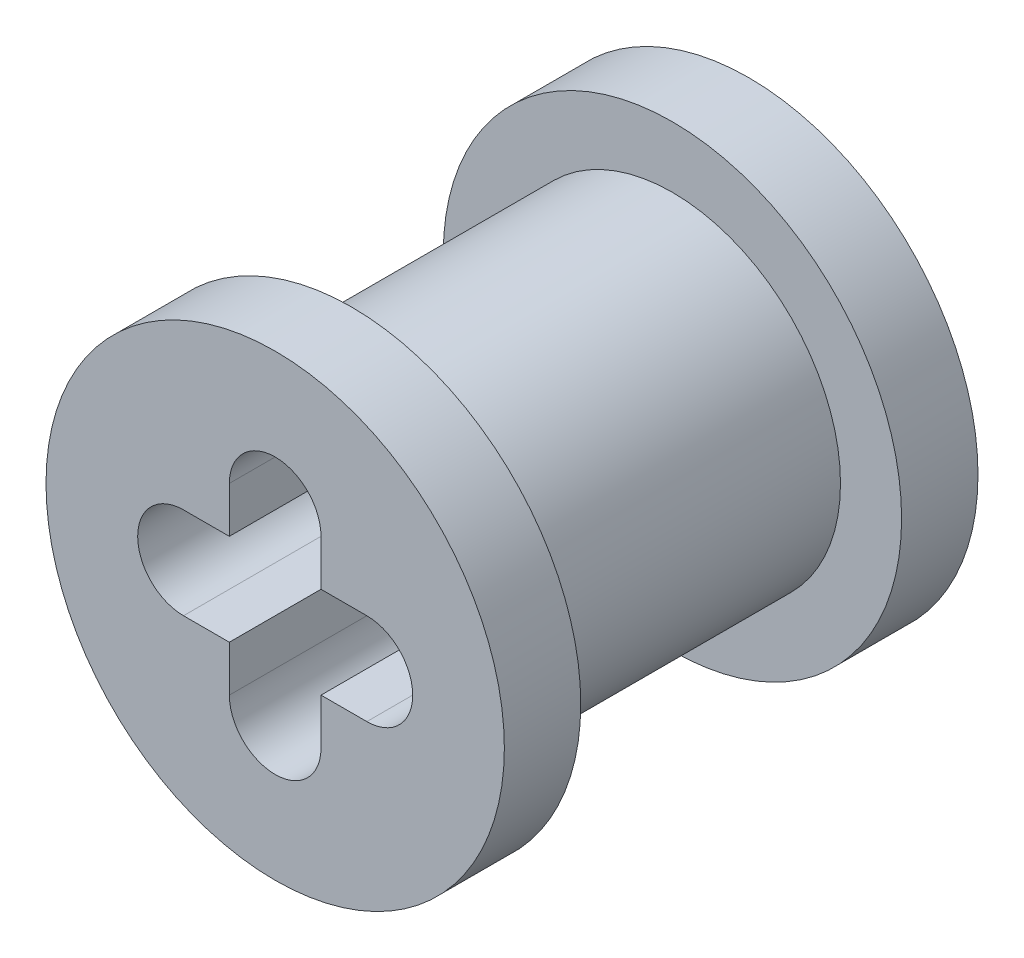
ISO-10303-21;
HEADER;
FILE_DESCRIPTION(('STEP AP214'),'2;1');
FILE_NAME('part.step','',(''),(''),'','','');
FILE_SCHEMA(('AUTOMOTIVE_DESIGN { 1 0 10303 214 1 1 1 1 }'));
ENDSEC;
DATA;
#1=APPLICATION_CONTEXT('core data for automotive mechanical design processes');
#2=APPLICATION_PROTOCOL_DEFINITION('international standard','automotive_design',2000,#1);
#3=PRODUCT_CONTEXT('',#1,'mechanical');
#4=PRODUCT('Part','Part','',(#3));
#5=PRODUCT_RELATED_PRODUCT_CATEGORY('part','',(#4));
#6=PRODUCT_DEFINITION_FORMATION('','',#4);
#7=PRODUCT_DEFINITION_CONTEXT('part definition',#1,'design');
#8=PRODUCT_DEFINITION('design','',#6,#7);
#9=PRODUCT_DEFINITION_SHAPE('','',#8);
#10=(LENGTH_UNIT() NAMED_UNIT(*) SI_UNIT(.MILLI.,.METRE.));
#11=(NAMED_UNIT(*) PLANE_ANGLE_UNIT() SI_UNIT($,.RADIAN.));
#12=(NAMED_UNIT(*) SI_UNIT($,.STERADIAN.) SOLID_ANGLE_UNIT());
#13=UNCERTAINTY_MEASURE_WITH_UNIT(LENGTH_MEASURE(1.E-05),#10,'distance_accuracy_value','');
#14=(GEOMETRIC_REPRESENTATION_CONTEXT(3) GLOBAL_UNCERTAINTY_ASSIGNED_CONTEXT((#13)) GLOBAL_UNIT_ASSIGNED_CONTEXT((#10,
#11,#12)) REPRESENTATION_CONTEXT('',''));
#15=CARTESIAN_POINT('',(0.,0.,0.));
#16=DIRECTION('',(0.,0.,1.));
#17=DIRECTION('',(1.,0.,0.));
#18=AXIS2_PLACEMENT_3D('',#15,#16,#17);
#19=CARTESIAN_POINT('',(7.874,0.,3.937));
#20=DIRECTION('',(0.,0.,-1.));
#21=DIRECTION('',(-1.,0.,0.));
#22=AXIS2_PLACEMENT_3D('',#19,#20,#21);
#23=CYLINDRICAL_SURFACE('',#22,2.794);
#24=CARTESIAN_POINT('',(7.874,0.,1.27));
#25=DIRECTION('',(0.,0.,-1.));
#26=DIRECTION('',(-1.,0.,0.));
#27=AXIS2_PLACEMENT_3D('',#24,#25,#26);
#28=CIRCLE('',#27,2.794);
#29=CARTESIAN_POINT('',(5.08,0.,1.27));
#30=VERTEX_POINT('',#29);
#31=EDGE_CURVE('E43',#30,#30,#28,.T.);
#32=ORIENTED_EDGE('',*,*,#31,.F.);
#33=EDGE_LOOP('',(#32));
#34=FACE_BOUND('',#33,.T.);
#35=CARTESIAN_POINT('',(7.874,0.,6.604));
#36=DIRECTION('',(0.,0.,1.));
#37=DIRECTION('',(1.,0.,0.));
#38=AXIS2_PLACEMENT_3D('',#35,#36,#37);
#39=CIRCLE('',#38,2.794);
#40=CARTESIAN_POINT('',(10.668,0.,6.604));
#41=VERTEX_POINT('',#40);
#42=EDGE_CURVE('E11',#41,#41,#39,.T.);
#43=ORIENTED_EDGE('',*,*,#42,.F.);
#44=EDGE_LOOP('',(#43));
#45=FACE_BOUND('',#44,.T.);
#46=ADVANCED_FACE('F36',(#34,#45),#23,.T.);
#47=CARTESIAN_POINT('',(7.874,-1.524,3.937));
#48=DIRECTION('',(0.,0.,-1.));
#49=DIRECTION('',(-1.,0.,0.));
#50=AXIS2_PLACEMENT_3D('',#47,#48,#49);
#51=CYLINDRICAL_SURFACE('',#50,0.762000000000002);
#52=CARTESIAN_POINT('',(7.874,-1.524,0.));
#53=DIRECTION('',(0.,0.,1.));
#54=DIRECTION('',(1.,0.,0.));
#55=AXIS2_PLACEMENT_3D('',#52,#53,#54);
#56=CIRCLE('',#55,0.762000000000002);
#57=CARTESIAN_POINT('',(7.112,-1.524,0.));
#58=VERTEX_POINT('',#57);
#59=CARTESIAN_POINT('',(8.636,-1.524,0.));
#60=VERTEX_POINT('',#59);
#61=EDGE_CURVE('E275',#58,#60,#56,.T.);
#62=ORIENTED_EDGE('',*,*,#61,.F.);
#63=DIRECTION('',(0.,0.,-1.));
#64=VECTOR('',#63,1.);
#65=CARTESIAN_POINT('',(7.112,-1.524,3.937));
#66=LINE('',#65,#64);
#67=CARTESIAN_POINT('',(7.112,-1.524,7.874));
#68=VERTEX_POINT('',#67);
#69=EDGE_CURVE('E131',#68,#58,#66,.T.);
#70=ORIENTED_EDGE('',*,*,#69,.F.);
#71=CARTESIAN_POINT('',(7.874,-1.524,7.874));
#72=DIRECTION('',(0.,0.,1.));
#73=DIRECTION('',(1.,0.,0.));
#74=AXIS2_PLACEMENT_3D('',#71,#72,#73);
#75=CIRCLE('',#74,0.762000000000002);
#76=CARTESIAN_POINT('',(8.636,-1.524,7.874));
#77=VERTEX_POINT('',#76);
#78=EDGE_CURVE('E129',#68,#77,#75,.T.);
#79=ORIENTED_EDGE('',*,*,#78,.T.);
#80=DIRECTION('',(0.,0.,-1.));
#81=VECTOR('',#80,1.);
#82=CARTESIAN_POINT('',(8.636,-1.524,3.937));
#83=LINE('',#82,#81);
#84=EDGE_CURVE('E50',#77,#60,#83,.T.);
#85=ORIENTED_EDGE('',*,*,#84,.T.);
#86=EDGE_LOOP('',(#62,#70,#79,#85));
#87=FACE_BOUND('',#86,.T.);
#88=ADVANCED_FACE('F130',(#87),#51,.F.);
#89=CARTESIAN_POINT('',(7.112,-6.28822135623731,3.937));
#90=DIRECTION('',(1.,0.,0.));
#91=DIRECTION('',(0.,0.,-1.));
#92=AXIS2_PLACEMENT_3D('',#89,#90,#91);
#93=PLANE('',#92);
#94=DIRECTION('',(0.,-1.,0.));
#95=VECTOR('',#94,1.);
#96=CARTESIAN_POINT('',(7.112,-6.28822135623731,0.));
#97=LINE('',#96,#95);
#98=CARTESIAN_POINT('',(7.112,-0.762000000000001,0.));
#99=VERTEX_POINT('',#98);
#100=EDGE_CURVE('E272',#99,#58,#97,.T.);
#101=ORIENTED_EDGE('',*,*,#100,.F.);
#102=DIRECTION('',(0.,0.,-1.));
#103=VECTOR('',#102,1.);
#104=CARTESIAN_POINT('',(7.112,-0.762000000000001,3.937));
#105=LINE('',#104,#103);
#106=CARTESIAN_POINT('',(7.112,-0.762000000000001,7.874));
#107=VERTEX_POINT('',#106);
#108=EDGE_CURVE('E183',#107,#99,#105,.T.);
#109=ORIENTED_EDGE('',*,*,#108,.F.);
#110=DIRECTION('',(0.,-1.,0.));
#111=VECTOR('',#110,1.);
#112=CARTESIAN_POINT('',(7.112,-6.28822135623731,7.874));
#113=LINE('',#112,#111);
#114=EDGE_CURVE('E171',#107,#68,#113,.T.);
#115=ORIENTED_EDGE('',*,*,#114,.T.);
#116=ORIENTED_EDGE('',*,*,#69,.T.);
#117=EDGE_LOOP('',(#101,#109,#115,#116));
#118=FACE_BOUND('',#117,.T.);
#119=ADVANCED_FACE('F261',(#118),#93,.T.);
#120=CARTESIAN_POINT('',(7.874,-0.762000000000001,3.937));
#121=DIRECTION('',(0.,1.,0.));
#122=DIRECTION('',(-1.,0.,0.));
#123=AXIS2_PLACEMENT_3D('',#120,#121,#122);
#124=PLANE('',#123);
#125=DIRECTION('',(1.,0.,0.));
#126=VECTOR('',#125,1.);
#127=CARTESIAN_POINT('',(7.874,-0.762000000000001,0.));
#128=LINE('',#127,#126);
#129=CARTESIAN_POINT('',(6.35,-0.762000000000002,0.));
#130=VERTEX_POINT('',#129);
#131=EDGE_CURVE('E274',#130,#99,#128,.T.);
#132=ORIENTED_EDGE('',*,*,#131,.F.);
#133=DIRECTION('',(0.,0.,-1.));
#134=VECTOR('',#133,1.);
#135=CARTESIAN_POINT('',(6.35,-0.762000000000002,3.937));
#136=LINE('',#135,#134);
#137=CARTESIAN_POINT('',(6.35,-0.762000000000002,7.874));
#138=VERTEX_POINT('',#137);
#139=EDGE_CURVE('E185',#138,#130,#136,.T.);
#140=ORIENTED_EDGE('',*,*,#139,.F.);
#141=DIRECTION('',(1.,0.,0.));
#142=VECTOR('',#141,1.);
#143=CARTESIAN_POINT('',(7.874,-0.762000000000001,7.874));
#144=LINE('',#143,#142);
#145=EDGE_CURVE('E147',#138,#107,#144,.T.);
#146=ORIENTED_EDGE('',*,*,#145,.T.);
#147=ORIENTED_EDGE('',*,*,#108,.T.);
#148=EDGE_LOOP('',(#132,#140,#146,#147));
#149=FACE_BOUND('',#148,.T.);
#150=ADVANCED_FACE('F182',(#149),#124,.T.);
#151=CARTESIAN_POINT('',(6.35,0.,3.937));
#152=DIRECTION('',(0.,0.,-1.));
#153=DIRECTION('',(-1.,0.,0.));
#154=AXIS2_PLACEMENT_3D('',#151,#152,#153);
#155=CYLINDRICAL_SURFACE('',#154,0.762000000000002);
#156=CARTESIAN_POINT('',(6.35,0.,0.));
#157=DIRECTION('',(0.,0.,1.));
#158=DIRECTION('',(1.,0.,0.));
#159=AXIS2_PLACEMENT_3D('',#156,#157,#158);
#160=CIRCLE('',#159,0.762000000000002);
#161=CARTESIAN_POINT('',(6.35,0.762000000000001,0.));
#162=VERTEX_POINT('',#161);
#163=EDGE_CURVE('E281',#162,#130,#160,.T.);
#164=ORIENTED_EDGE('',*,*,#163,.F.);
#165=DIRECTION('',(0.,0.,-1.));
#166=VECTOR('',#165,1.);
#167=CARTESIAN_POINT('',(6.35,0.762000000000001,3.937));
#168=LINE('',#167,#166);
#169=CARTESIAN_POINT('',(6.35,0.762000000000001,7.874));
#170=VERTEX_POINT('',#169);
#171=EDGE_CURVE('E190',#170,#162,#168,.T.);
#172=ORIENTED_EDGE('',*,*,#171,.F.);
#173=CARTESIAN_POINT('',(6.35,0.,7.874));
#174=DIRECTION('',(0.,0.,1.));
#175=DIRECTION('',(1.,0.,0.));
#176=AXIS2_PLACEMENT_3D('',#173,#174,#175);
#177=CIRCLE('',#176,0.762000000000002);
#178=EDGE_CURVE('E163',#170,#138,#177,.T.);
#179=ORIENTED_EDGE('',*,*,#178,.T.);
#180=ORIENTED_EDGE('',*,*,#139,.T.);
#181=EDGE_LOOP('',(#164,#172,#179,#180));
#182=FACE_BOUND('',#181,.T.);
#183=ADVANCED_FACE('F262',(#182),#155,.F.);
#184=CARTESIAN_POINT('',(7.874,0.762000000000001,3.937));
#185=DIRECTION('',(0.,1.,0.));
#186=DIRECTION('',(-1.,0.,0.));
#187=AXIS2_PLACEMENT_3D('',#184,#185,#186);
#188=PLANE('',#187);
#189=DIRECTION('',(1.,0.,0.));
#190=VECTOR('',#189,1.);
#191=CARTESIAN_POINT('',(7.874,0.762000000000001,0.));
#192=LINE('',#191,#190);
#193=CARTESIAN_POINT('',(7.112,0.762000000000001,0.));
#194=VERTEX_POINT('',#193);
#195=EDGE_CURVE('E193',#162,#194,#192,.T.);
#196=ORIENTED_EDGE('',*,*,#195,.T.);
#197=DIRECTION('',(0.,0.,-1.));
#198=VECTOR('',#197,1.);
#199=CARTESIAN_POINT('',(7.112,0.762000000000001,3.937));
#200=LINE('',#199,#198);
#201=CARTESIAN_POINT('',(7.112,0.762000000000001,7.874));
#202=VERTEX_POINT('',#201);
#203=EDGE_CURVE('E192',#202,#194,#200,.T.);
#204=ORIENTED_EDGE('',*,*,#203,.F.);
#205=DIRECTION('',(1.,0.,0.));
#206=VECTOR('',#205,1.);
#207=CARTESIAN_POINT('',(7.874,0.762000000000001,7.874));
#208=LINE('',#207,#206);
#209=EDGE_CURVE('E158',#170,#202,#208,.T.);
#210=ORIENTED_EDGE('',*,*,#209,.F.);
#211=ORIENTED_EDGE('',*,*,#171,.T.);
#212=EDGE_LOOP('',(#196,#204,#210,#211));
#213=FACE_BOUND('',#212,.T.);
#214=ADVANCED_FACE('F189',(#213),#188,.F.);
#215=CARTESIAN_POINT('',(7.112,1.524,0.));
#216=VERTEX_POINT('',#215);
#217=EDGE_CURVE('E277',#216,#194,#97,.T.);
#218=ORIENTED_EDGE('',*,*,#217,.F.);
#219=DIRECTION('',(0.,0.,-1.));
#220=VECTOR('',#219,1.);
#221=CARTESIAN_POINT('',(7.112,1.524,3.937));
#222=LINE('',#221,#220);
#223=CARTESIAN_POINT('',(7.112,1.524,7.874));
#224=VERTEX_POINT('',#223);
#225=EDGE_CURVE('E196',#224,#216,#222,.T.);
#226=ORIENTED_EDGE('',*,*,#225,.F.);
#227=EDGE_CURVE('E155',#224,#202,#113,.T.);
#228=ORIENTED_EDGE('',*,*,#227,.T.);
#229=ORIENTED_EDGE('',*,*,#203,.T.);
#230=EDGE_LOOP('',(#218,#226,#228,#229));
#231=FACE_BOUND('',#230,.T.);
#232=ADVANCED_FACE('F257',(#231),#93,.T.);
#233=CARTESIAN_POINT('',(7.874,1.524,3.937));
#234=DIRECTION('',(0.,0.,-1.));
#235=DIRECTION('',(-1.,0.,0.));
#236=AXIS2_PLACEMENT_3D('',#233,#234,#235);
#237=CYLINDRICAL_SURFACE('',#236,0.762000000000002);
#238=CARTESIAN_POINT('',(7.874,1.524,0.));
#239=DIRECTION('',(0.,0.,1.));
#240=DIRECTION('',(1.,0.,0.));
#241=AXIS2_PLACEMENT_3D('',#238,#239,#240);
#242=CIRCLE('',#241,0.762000000000002);
#243=CARTESIAN_POINT('',(8.636,1.524,0.));
#244=VERTEX_POINT('',#243);
#245=EDGE_CURVE('E310',#244,#216,#242,.T.);
#246=ORIENTED_EDGE('',*,*,#245,.F.);
#247=DIRECTION('',(0.,0.,-1.));
#248=VECTOR('',#247,1.);
#249=CARTESIAN_POINT('',(8.636,1.524,3.937));
#250=LINE('',#249,#248);
#251=CARTESIAN_POINT('',(8.636,1.524,7.874));
#252=VERTEX_POINT('',#251);
#253=EDGE_CURVE('E199',#252,#244,#250,.T.);
#254=ORIENTED_EDGE('',*,*,#253,.F.);
#255=CARTESIAN_POINT('',(7.874,1.524,7.874));
#256=DIRECTION('',(0.,0.,1.));
#257=DIRECTION('',(1.,0.,0.));
#258=AXIS2_PLACEMENT_3D('',#255,#256,#257);
#259=CIRCLE('',#258,0.762000000000002);
#260=EDGE_CURVE('E149',#252,#224,#259,.T.);
#261=ORIENTED_EDGE('',*,*,#260,.T.);
#262=ORIENTED_EDGE('',*,*,#225,.T.);
#263=EDGE_LOOP('',(#246,#254,#261,#262));
#264=FACE_BOUND('',#263,.T.);
#265=ADVANCED_FACE('F254',(#264),#237,.F.);
#266=CARTESIAN_POINT('',(8.636,-6.28822135623731,3.937));
#267=DIRECTION('',(1.,0.,0.));
#268=DIRECTION('',(0.,0.,-1.));
#269=AXIS2_PLACEMENT_3D('',#266,#267,#268);
#270=PLANE('',#269);
#271=DIRECTION('',(0.,-1.,0.));
#272=VECTOR('',#271,1.);
#273=CARTESIAN_POINT('',(8.636,-6.28822135623731,0.));
#274=LINE('',#273,#272);
#275=CARTESIAN_POINT('',(8.636,0.762000000000001,0.));
#276=VERTEX_POINT('',#275);
#277=EDGE_CURVE('E290',#244,#276,#274,.T.);
#278=ORIENTED_EDGE('',*,*,#277,.T.);
#279=DIRECTION('',(0.,0.,-1.));
#280=VECTOR('',#279,1.);
#281=CARTESIAN_POINT('',(8.636,0.762000000000001,3.937));
#282=LINE('',#281,#280);
#283=CARTESIAN_POINT('',(8.636,0.762000000000001,7.874));
#284=VERTEX_POINT('',#283);
#285=EDGE_CURVE('E303',#284,#276,#282,.T.);
#286=ORIENTED_EDGE('',*,*,#285,.F.);
#287=DIRECTION('',(0.,-1.,0.));
#288=VECTOR('',#287,1.);
#289=CARTESIAN_POINT('',(8.636,-6.28822135623731,7.874));
#290=LINE('',#289,#288);
#291=EDGE_CURVE('E144',#252,#284,#290,.T.);
#292=ORIENTED_EDGE('',*,*,#291,.F.);
#293=ORIENTED_EDGE('',*,*,#253,.T.);
#294=EDGE_LOOP('',(#278,#286,#292,#293));
#295=FACE_BOUND('',#294,.T.);
#296=ADVANCED_FACE('F242',(#295),#270,.F.);
#297=CARTESIAN_POINT('',(9.398,0.762000000000002,0.));
#298=VERTEX_POINT('',#297);
#299=EDGE_CURVE('E291',#276,#298,#192,.T.);
#300=ORIENTED_EDGE('',*,*,#299,.T.);
#301=DIRECTION('',(0.,0.,-1.));
#302=VECTOR('',#301,1.);
#303=CARTESIAN_POINT('',(9.398,0.762000000000002,3.937));
#304=LINE('',#303,#302);
#305=CARTESIAN_POINT('',(9.398,0.762000000000002,7.874));
#306=VERTEX_POINT('',#305);
#307=EDGE_CURVE('E301',#306,#298,#304,.T.);
#308=ORIENTED_EDGE('',*,*,#307,.F.);
#309=EDGE_CURVE('E150',#284,#306,#208,.T.);
#310=ORIENTED_EDGE('',*,*,#309,.F.);
#311=ORIENTED_EDGE('',*,*,#285,.T.);
#312=EDGE_LOOP('',(#300,#308,#310,#311));
#313=FACE_BOUND('',#312,.T.);
#314=ADVANCED_FACE('F249',(#313),#188,.F.);
#315=CARTESIAN_POINT('',(9.398,0.,3.937));
#316=DIRECTION('',(0.,0.,-1.));
#317=DIRECTION('',(-1.,0.,0.));
#318=AXIS2_PLACEMENT_3D('',#315,#316,#317);
#319=CYLINDRICAL_SURFACE('',#318,0.762000000000002);
#320=CARTESIAN_POINT('',(9.398,0.,0.));
#321=DIRECTION('',(0.,0.,1.));
#322=DIRECTION('',(1.,0.,0.));
#323=AXIS2_PLACEMENT_3D('',#320,#321,#322);
#324=CIRCLE('',#323,0.762000000000002);
#325=CARTESIAN_POINT('',(9.398,-0.762000000000001,0.));
#326=VERTEX_POINT('',#325);
#327=EDGE_CURVE('E286',#326,#298,#324,.T.);
#328=ORIENTED_EDGE('',*,*,#327,.F.);
#329=DIRECTION('',(0.,0.,-1.));
#330=VECTOR('',#329,1.);
#331=CARTESIAN_POINT('',(9.398,-0.762000000000001,3.937));
#332=LINE('',#331,#330);
#333=CARTESIAN_POINT('',(9.398,-0.762000000000001,7.874));
#334=VERTEX_POINT('',#333);
#335=EDGE_CURVE('E299',#334,#326,#332,.T.);
#336=ORIENTED_EDGE('',*,*,#335,.F.);
#337=CARTESIAN_POINT('',(9.398,0.,7.874));
#338=DIRECTION('',(0.,0.,1.));
#339=DIRECTION('',(1.,0.,0.));
#340=AXIS2_PLACEMENT_3D('',#337,#338,#339);
#341=CIRCLE('',#340,0.762000000000002);
#342=EDGE_CURVE('E145',#334,#306,#341,.T.);
#343=ORIENTED_EDGE('',*,*,#342,.T.);
#344=ORIENTED_EDGE('',*,*,#307,.T.);
#345=EDGE_LOOP('',(#328,#336,#343,#344));
#346=FACE_BOUND('',#345,.T.);
#347=ADVANCED_FACE('F245',(#346),#319,.F.);
#348=CARTESIAN_POINT('',(8.636,-0.762000000000001,0.));
#349=VERTEX_POINT('',#348);
#350=EDGE_CURVE('E283',#349,#326,#128,.T.);
#351=ORIENTED_EDGE('',*,*,#350,.F.);
#352=DIRECTION('',(0.,0.,-1.));
#353=VECTOR('',#352,1.);
#354=CARTESIAN_POINT('',(8.636,-0.762000000000001,3.937));
#355=LINE('',#354,#353);
#356=CARTESIAN_POINT('',(8.636,-0.762000000000001,7.874));
#357=VERTEX_POINT('',#356);
#358=EDGE_CURVE('E57',#357,#349,#355,.T.);
#359=ORIENTED_EDGE('',*,*,#358,.F.);
#360=EDGE_CURVE('E142',#357,#334,#144,.T.);
#361=ORIENTED_EDGE('',*,*,#360,.T.);
#362=ORIENTED_EDGE('',*,*,#335,.T.);
#363=EDGE_LOOP('',(#351,#359,#361,#362));
#364=FACE_BOUND('',#363,.T.);
#365=ADVANCED_FACE('F241',(#364),#124,.T.);
#366=EDGE_CURVE('E125',#349,#60,#274,.T.);
#367=ORIENTED_EDGE('',*,*,#366,.T.);
#368=ORIENTED_EDGE('',*,*,#84,.F.);
#369=EDGE_CURVE('E124',#357,#77,#290,.T.);
#370=ORIENTED_EDGE('',*,*,#369,.F.);
#371=ORIENTED_EDGE('',*,*,#358,.T.);
#372=EDGE_LOOP('',(#367,#368,#370,#371));
#373=FACE_BOUND('',#372,.T.);
#374=ADVANCED_FACE('F122',(#373),#270,.F.);
#375=CARTESIAN_POINT('',(7.874,-6.28822135623731,0.));
#376=DIRECTION('',(0.,0.,1.));
#377=DIRECTION('',(1.,0.,0.));
#378=AXIS2_PLACEMENT_3D('',#375,#376,#377);
#379=PLANE('',#378);
#380=ORIENTED_EDGE('',*,*,#61,.T.);
#381=ORIENTED_EDGE('',*,*,#366,.F.);
#382=ORIENTED_EDGE('',*,*,#350,.T.);
#383=ORIENTED_EDGE('',*,*,#327,.T.);
#384=ORIENTED_EDGE('',*,*,#299,.F.);
#385=ORIENTED_EDGE('',*,*,#277,.F.);
#386=ORIENTED_EDGE('',*,*,#245,.T.);
#387=ORIENTED_EDGE('',*,*,#217,.T.);
#388=ORIENTED_EDGE('',*,*,#195,.F.);
#389=ORIENTED_EDGE('',*,*,#163,.T.);
#390=ORIENTED_EDGE('',*,*,#131,.T.);
#391=ORIENTED_EDGE('',*,*,#100,.T.);
#392=EDGE_LOOP('',(#380,#381,#382,#383,#384,#385,#386,#387,#388,#389,#390,#391));
#393=FACE_BOUND('',#392,.T.);
#394=CARTESIAN_POINT('',(7.874,0.,0.));
#395=DIRECTION('',(0.,0.,-1.));
#396=DIRECTION('',(-1.,0.,0.));
#397=AXIS2_PLACEMENT_3D('',#394,#395,#396);
#398=CIRCLE('',#397,3.81);
#399=CARTESIAN_POINT('',(4.064,0.,0.));
#400=VERTEX_POINT('',#399);
#401=EDGE_CURVE('E173',#400,#400,#398,.T.);
#402=ORIENTED_EDGE('',*,*,#401,.T.);
#403=EDGE_LOOP('',(#402));
#404=FACE_BOUND('',#403,.T.);
#405=ADVANCED_FACE('F234',(#393,#404),#379,.F.);
#406=CARTESIAN_POINT('',(7.874,0.,1.27));
#407=DIRECTION('',(0.,0.,-1.));
#408=DIRECTION('',(-1.,0.,0.));
#409=AXIS2_PLACEMENT_3D('',#406,#407,#408);
#410=CYLINDRICAL_SURFACE('',#409,3.81);
#411=CARTESIAN_POINT('',(7.874,0.,1.27));
#412=DIRECTION('',(0.,0.,-1.));
#413=DIRECTION('',(-1.,0.,0.));
#414=AXIS2_PLACEMENT_3D('',#411,#412,#413);
#415=CIRCLE('',#414,3.81);
#416=CARTESIAN_POINT('',(4.064,0.,1.27));
#417=VERTEX_POINT('',#416);
#418=EDGE_CURVE('E176',#417,#417,#415,.T.);
#419=ORIENTED_EDGE('',*,*,#418,.T.);
#420=EDGE_LOOP('',(#419));
#421=FACE_BOUND('',#420,.T.);
#422=ORIENTED_EDGE('',*,*,#401,.F.);
#423=EDGE_LOOP('',(#422));
#424=FACE_BOUND('',#423,.T.);
#425=ADVANCED_FACE('F231',(#421,#424),#410,.T.);
#426=CARTESIAN_POINT('',(7.874,0.,1.27));
#427=DIRECTION('',(0.,0.,-1.));
#428=DIRECTION('',(-1.,0.,0.));
#429=AXIS2_PLACEMENT_3D('',#426,#427,#428);
#430=PLANE('',#429);
#431=ORIENTED_EDGE('',*,*,#31,.T.);
#432=EDGE_LOOP('',(#431));
#433=FACE_BOUND('',#432,.T.);
#434=ORIENTED_EDGE('',*,*,#418,.F.);
#435=EDGE_LOOP('',(#434));
#436=FACE_BOUND('',#435,.T.);
#437=ADVANCED_FACE('F208',(#433,#436),#430,.F.);
#438=CARTESIAN_POINT('',(7.874,-6.28822135623731,7.874));
#439=DIRECTION('',(0.,0.,-1.));
#440=DIRECTION('',(1.,0.,0.));
#441=AXIS2_PLACEMENT_3D('',#438,#439,#440);
#442=PLANE('',#441);
#443=ORIENTED_EDGE('',*,*,#78,.F.);
#444=ORIENTED_EDGE('',*,*,#114,.F.);
#445=ORIENTED_EDGE('',*,*,#145,.F.);
#446=ORIENTED_EDGE('',*,*,#178,.F.);
#447=ORIENTED_EDGE('',*,*,#209,.T.);
#448=ORIENTED_EDGE('',*,*,#227,.F.);
#449=ORIENTED_EDGE('',*,*,#260,.F.);
#450=ORIENTED_EDGE('',*,*,#291,.T.);
#451=ORIENTED_EDGE('',*,*,#309,.T.);
#452=ORIENTED_EDGE('',*,*,#342,.F.);
#453=ORIENTED_EDGE('',*,*,#360,.F.);
#454=ORIENTED_EDGE('',*,*,#369,.T.);
#455=EDGE_LOOP('',(#443,#444,#445,#446,#447,#448,#449,#450,#451,#452,#453,#454));
#456=FACE_BOUND('',#455,.T.);
#457=CARTESIAN_POINT('',(7.874,0.,7.874));
#458=DIRECTION('',(0.,0.,-1.));
#459=DIRECTION('',(-1.,0.,0.));
#460=AXIS2_PLACEMENT_3D('',#457,#458,#459);
#461=CIRCLE('',#460,3.81);
#462=CARTESIAN_POINT('',(4.064,0.,7.874));
#463=VERTEX_POINT('',#462);
#464=EDGE_CURVE('E483',#463,#463,#461,.T.);
#465=ORIENTED_EDGE('',*,*,#464,.F.);
#466=EDGE_LOOP('',(#465));
#467=FACE_BOUND('',#466,.T.);
#468=ADVANCED_FACE('F138',(#456,#467),#442,.F.);
#469=CARTESIAN_POINT('',(7.874,0.,6.604));
#470=DIRECTION('',(0.,0.,1.));
#471=DIRECTION('',(-1.,0.,0.));
#472=AXIS2_PLACEMENT_3D('',#469,#470,#471);
#473=PLANE('',#472);
#474=CARTESIAN_POINT('',(7.874,0.,6.604));
#475=DIRECTION('',(0.,0.,-1.));
#476=DIRECTION('',(-1.,0.,0.));
#477=AXIS2_PLACEMENT_3D('',#474,#475,#476);
#478=CIRCLE('',#477,3.81);
#479=CARTESIAN_POINT('',(4.064,0.,6.604));
#480=VERTEX_POINT('',#479);
#481=EDGE_CURVE('E135',#480,#480,#478,.T.);
#482=ORIENTED_EDGE('',*,*,#481,.T.);
#483=EDGE_LOOP('',(#482));
#484=FACE_BOUND('',#483,.T.);
#485=ORIENTED_EDGE('',*,*,#42,.T.);
#486=EDGE_LOOP('',(#485));
#487=FACE_BOUND('',#486,.T.);
#488=ADVANCED_FACE('F215',(#484,#487),#473,.F.);
#489=CARTESIAN_POINT('',(7.874,0.,6.604));
#490=DIRECTION('',(0.,0.,1.));
#491=DIRECTION('',(1.,0.,0.));
#492=AXIS2_PLACEMENT_3D('',#489,#490,#491);
#493=CYLINDRICAL_SURFACE('',#492,3.81);
#494=ORIENTED_EDGE('',*,*,#481,.F.);
#495=EDGE_LOOP('',(#494));
#496=FACE_BOUND('',#495,.T.);
#497=ORIENTED_EDGE('',*,*,#464,.T.);
#498=EDGE_LOOP('',(#497));
#499=FACE_BOUND('',#498,.T.);
#500=ADVANCED_FACE('F217',(#496,#499),#493,.T.);
#501=CLOSED_SHELL('',(#46,#88,#119,#150,#183,#214,#232,#265,#296,#314,#347,#365,#374,#405,#425,
#437,#468,#488,#500));
#502=MANIFOLD_SOLID_BREP('B2',#501);
#503=ADVANCED_BREP_SHAPE_REPRESENTATION('',(#18,#502),#14);
#504=SHAPE_DEFINITION_REPRESENTATION(#9,#503);
ENDSEC;
END-ISO-10303-21;
